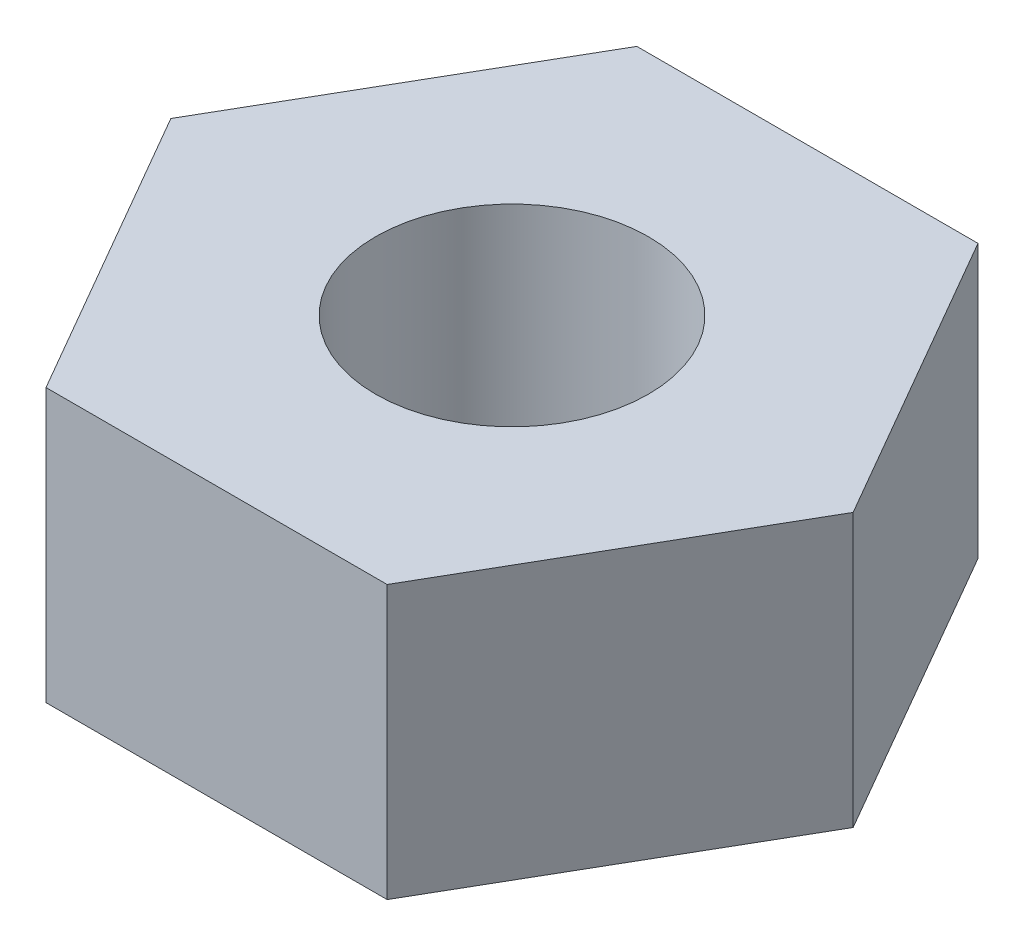
ISO-10303-21;
HEADER;
FILE_DESCRIPTION(('STEP AP214'),'2;1');
FILE_NAME('part.step','',(''),(''),'','','');
FILE_SCHEMA(('AUTOMOTIVE_DESIGN { 1 0 10303 214 1 1 1 1 }'));
ENDSEC;
DATA;
#1=APPLICATION_CONTEXT('core data for automotive mechanical design processes');
#2=APPLICATION_PROTOCOL_DEFINITION('international standard','automotive_design',2000,#1);
#3=PRODUCT_CONTEXT('',#1,'mechanical');
#4=PRODUCT('Part','Part','',(#3));
#5=PRODUCT_RELATED_PRODUCT_CATEGORY('part','',(#4));
#6=PRODUCT_DEFINITION_FORMATION('','',#4);
#7=PRODUCT_DEFINITION_CONTEXT('part definition',#1,'design');
#8=PRODUCT_DEFINITION('design','',#6,#7);
#9=PRODUCT_DEFINITION_SHAPE('','',#8);
#10=(LENGTH_UNIT() NAMED_UNIT(*) SI_UNIT(.MILLI.,.METRE.));
#11=(NAMED_UNIT(*) PLANE_ANGLE_UNIT() SI_UNIT($,.RADIAN.));
#12=(NAMED_UNIT(*) SI_UNIT($,.STERADIAN.) SOLID_ANGLE_UNIT());
#13=UNCERTAINTY_MEASURE_WITH_UNIT(LENGTH_MEASURE(1.E-05),#10,'distance_accuracy_value','');
#14=(GEOMETRIC_REPRESENTATION_CONTEXT(3) GLOBAL_UNCERTAINTY_ASSIGNED_CONTEXT((#13)) GLOBAL_UNIT_ASSIGNED_CONTEXT((#10,
#11,#12)) REPRESENTATION_CONTEXT('',''));
#15=CARTESIAN_POINT('',(0.,0.,0.));
#16=DIRECTION('',(0.,0.,1.));
#17=DIRECTION('',(1.,0.,0.));
#18=AXIS2_PLACEMENT_3D('',#15,#16,#17);
#19=CARTESIAN_POINT('',(0.,4.,0.));
#20=DIRECTION('',(0.,1.,0.));
#21=DIRECTION('',(0.,0.,1.));
#22=AXIS2_PLACEMENT_3D('',#19,#20,#21);
#23=PLANE('',#22);
#24=DIRECTION('',(0.499999999999995,0.,-0.866025403784441));
#25=VECTOR('',#24,1.);
#26=CARTESIAN_POINT('',(2.50000000000005,4.,4.33012701892216));
#27=LINE('',#26,#25);
#28=CARTESIAN_POINT('',(2.50000000000005,4.,4.33012701892216));
#29=VERTEX_POINT('',#28);
#30=CARTESIAN_POINT('',(5.,4.,0.));
#31=VERTEX_POINT('',#30);
#32=EDGE_CURVE('E135',#29,#31,#27,.T.);
#33=ORIENTED_EDGE('',*,*,#32,.T.);
#34=DIRECTION('',(-0.500000000000001,0.,-0.866025403784438));
#35=VECTOR('',#34,1.);
#36=CARTESIAN_POINT('',(5.,4.,0.));
#37=LINE('',#36,#35);
#38=CARTESIAN_POINT('',(2.49999999999999,4.,-4.3301270189222));
#39=VERTEX_POINT('',#38);
#40=EDGE_CURVE('E93',#31,#39,#37,.T.);
#41=ORIENTED_EDGE('',*,*,#40,.T.);
#42=DIRECTION('',(-1.,0.,0.));
#43=VECTOR('',#42,1.);
#44=CARTESIAN_POINT('',(2.49999999999999,4.,-4.3301270189222));
#45=LINE('',#44,#43);
#46=CARTESIAN_POINT('',(-2.50000000000002,4.,-4.33012701892218));
#47=VERTEX_POINT('',#46);
#48=EDGE_CURVE('E106',#39,#47,#45,.T.);
#49=ORIENTED_EDGE('',*,*,#48,.T.);
#50=DIRECTION('',(-0.499999999999995,0.,0.866025403784442));
#51=VECTOR('',#50,1.);
#52=CARTESIAN_POINT('',(-2.50000000000002,4.,-4.33012701892218));
#53=LINE('',#52,#51);
#54=CARTESIAN_POINT('',(-5.,4.,0.));
#55=VERTEX_POINT('',#54);
#56=EDGE_CURVE('E100',#47,#55,#53,.T.);
#57=ORIENTED_EDGE('',*,*,#56,.T.);
#58=DIRECTION('',(0.500000000000007,0.,0.866025403784434));
#59=VECTOR('',#58,1.);
#60=CARTESIAN_POINT('',(-5.,4.,0.));
#61=LINE('',#60,#59);
#62=CARTESIAN_POINT('',(-2.49999999999996,4.,4.33012701892222));
#63=VERTEX_POINT('',#62);
#64=EDGE_CURVE('E104',#55,#63,#61,.T.);
#65=ORIENTED_EDGE('',*,*,#64,.T.);
#66=DIRECTION('',(1.,0.,0.));
#67=VECTOR('',#66,1.);
#68=CARTESIAN_POINT('',(-2.49999999999996,4.,4.33012701892222));
#69=LINE('',#68,#67);
#70=EDGE_CURVE('E56',#63,#29,#69,.T.);
#71=ORIENTED_EDGE('',*,*,#70,.T.);
#72=EDGE_LOOP('',(#33,#41,#49,#57,#65,#71));
#73=FACE_BOUND('',#72,.T.);
#74=CARTESIAN_POINT('',(0.,4.,0.));
#75=DIRECTION('',(0.,1.,0.));
#76=DIRECTION('',(0.,0.,1.));
#77=AXIS2_PLACEMENT_3D('',#74,#75,#76);
#78=CIRCLE('',#77,2.);
#79=CARTESIAN_POINT('',(0.,4.,2.));
#80=VERTEX_POINT('',#79);
#81=EDGE_CURVE('E128',#80,#80,#78,.T.);
#82=ORIENTED_EDGE('',*,*,#81,.F.);
#83=EDGE_LOOP('',(#82));
#84=FACE_BOUND('',#83,.T.);
#85=ADVANCED_FACE('F39',(#73,#84),#23,.T.);
#86=CARTESIAN_POINT('',(0.,0.,0.));
#87=DIRECTION('',(0.,1.,0.));
#88=DIRECTION('',(0.,0.,1.));
#89=AXIS2_PLACEMENT_3D('',#86,#87,#88);
#90=PLANE('',#89);
#91=DIRECTION('',(0.499999999999995,0.,-0.866025403784441));
#92=VECTOR('',#91,1.);
#93=CARTESIAN_POINT('',(2.50000000000005,0.,4.33012701892216));
#94=LINE('',#93,#92);
#95=CARTESIAN_POINT('',(2.50000000000005,0.,4.33012701892216));
#96=VERTEX_POINT('',#95);
#97=CARTESIAN_POINT('',(5.,0.,0.));
#98=VERTEX_POINT('',#97);
#99=EDGE_CURVE('E124',#96,#98,#94,.T.);
#100=ORIENTED_EDGE('',*,*,#99,.F.);
#101=DIRECTION('',(1.,0.,0.));
#102=VECTOR('',#101,1.);
#103=CARTESIAN_POINT('',(-2.49999999999996,0.,4.33012701892222));
#104=LINE('',#103,#102);
#105=CARTESIAN_POINT('',(-2.49999999999996,0.,4.33012701892222));
#106=VERTEX_POINT('',#105);
#107=EDGE_CURVE('E85',#106,#96,#104,.T.);
#108=ORIENTED_EDGE('',*,*,#107,.F.);
#109=DIRECTION('',(0.500000000000007,0.,0.866025403784434));
#110=VECTOR('',#109,1.);
#111=CARTESIAN_POINT('',(-5.,0.,0.));
#112=LINE('',#111,#110);
#113=CARTESIAN_POINT('',(-5.,0.,0.));
#114=VERTEX_POINT('',#113);
#115=EDGE_CURVE('E79',#114,#106,#112,.T.);
#116=ORIENTED_EDGE('',*,*,#115,.F.);
#117=DIRECTION('',(-0.499999999999995,0.,0.866025403784442));
#118=VECTOR('',#117,1.);
#119=CARTESIAN_POINT('',(-2.50000000000002,0.,-4.33012701892218));
#120=LINE('',#119,#118);
#121=CARTESIAN_POINT('',(-2.50000000000002,0.,-4.33012701892218));
#122=VERTEX_POINT('',#121);
#123=EDGE_CURVE('E114',#122,#114,#120,.T.);
#124=ORIENTED_EDGE('',*,*,#123,.F.);
#125=DIRECTION('',(-1.,0.,0.));
#126=VECTOR('',#125,1.);
#127=CARTESIAN_POINT('',(2.49999999999999,0.,-4.3301270189222));
#128=LINE('',#127,#126);
#129=CARTESIAN_POINT('',(2.49999999999999,0.,-4.3301270189222));
#130=VERTEX_POINT('',#129);
#131=EDGE_CURVE('E130',#130,#122,#128,.T.);
#132=ORIENTED_EDGE('',*,*,#131,.F.);
#133=DIRECTION('',(-0.500000000000001,0.,-0.866025403784438));
#134=VECTOR('',#133,1.);
#135=CARTESIAN_POINT('',(5.,0.,0.));
#136=LINE('',#135,#134);
#137=EDGE_CURVE('E127',#98,#130,#136,.T.);
#138=ORIENTED_EDGE('',*,*,#137,.F.);
#139=EDGE_LOOP('',(#100,#108,#116,#124,#132,#138));
#140=FACE_BOUND('',#139,.T.);
#141=CARTESIAN_POINT('',(0.,0.,0.));
#142=DIRECTION('',(0.,1.,0.));
#143=DIRECTION('',(0.,0.,1.));
#144=AXIS2_PLACEMENT_3D('',#141,#142,#143);
#145=CIRCLE('',#144,2.);
#146=CARTESIAN_POINT('',(0.,0.,2.));
#147=VERTEX_POINT('',#146);
#148=EDGE_CURVE('E228',#147,#147,#145,.T.);
#149=ORIENTED_EDGE('',*,*,#148,.T.);
#150=EDGE_LOOP('',(#149));
#151=FACE_BOUND('',#150,.T.);
#152=ADVANCED_FACE('F144',(#140,#151),#90,.F.);
#153=CARTESIAN_POINT('',(2.50000000000005,4.,4.33012701892216));
#154=DIRECTION('',(-0.866025403784441,0.,-0.499999999999995));
#155=DIRECTION('',(-0.499999999999995,0.,0.866025403784442));
#156=AXIS2_PLACEMENT_3D('',#153,#154,#155);
#157=PLANE('',#156);
#158=ORIENTED_EDGE('',*,*,#99,.T.);
#159=DIRECTION('',(0.,-1.,0.));
#160=VECTOR('',#159,1.);
#161=CARTESIAN_POINT('',(5.,4.,0.));
#162=LINE('',#161,#160);
#163=EDGE_CURVE('E11',#31,#98,#162,.T.);
#164=ORIENTED_EDGE('',*,*,#163,.F.);
#165=ORIENTED_EDGE('',*,*,#32,.F.);
#166=DIRECTION('',(0.,-1.,0.));
#167=VECTOR('',#166,1.);
#168=CARTESIAN_POINT('',(2.50000000000005,4.,4.33012701892216));
#169=LINE('',#168,#167);
#170=EDGE_CURVE('E120',#29,#96,#169,.T.);
#171=ORIENTED_EDGE('',*,*,#170,.T.);
#172=EDGE_LOOP('',(#158,#164,#165,#171));
#173=FACE_BOUND('',#172,.T.);
#174=ADVANCED_FACE('F41',(#173),#157,.F.);
#175=CARTESIAN_POINT('',(5.,4.,0.));
#176=DIRECTION('',(-0.866025403784438,0.,0.500000000000001));
#177=DIRECTION('',(0.500000000000001,0.,0.866025403784438));
#178=AXIS2_PLACEMENT_3D('',#175,#176,#177);
#179=PLANE('',#178);
#180=ORIENTED_EDGE('',*,*,#137,.T.);
#181=DIRECTION('',(0.,-1.,0.));
#182=VECTOR('',#181,1.);
#183=CARTESIAN_POINT('',(2.49999999999999,4.,-4.3301270189222));
#184=LINE('',#183,#182);
#185=EDGE_CURVE('E48',#39,#130,#184,.T.);
#186=ORIENTED_EDGE('',*,*,#185,.F.);
#187=ORIENTED_EDGE('',*,*,#40,.F.);
#188=ORIENTED_EDGE('',*,*,#163,.T.);
#189=EDGE_LOOP('',(#180,#186,#187,#188));
#190=FACE_BOUND('',#189,.T.);
#191=ADVANCED_FACE('F169',(#190),#179,.F.);
#192=CARTESIAN_POINT('',(2.49999999999999,4.,-4.3301270189222));
#193=DIRECTION('',(0.,0.,1.));
#194=DIRECTION('',(1.,0.,0.));
#195=AXIS2_PLACEMENT_3D('',#192,#193,#194);
#196=PLANE('',#195);
#197=ORIENTED_EDGE('',*,*,#131,.T.);
#198=DIRECTION('',(0.,-1.,0.));
#199=VECTOR('',#198,1.);
#200=CARTESIAN_POINT('',(-2.50000000000002,4.,-4.33012701892218));
#201=LINE('',#200,#199);
#202=EDGE_CURVE('E115',#47,#122,#201,.T.);
#203=ORIENTED_EDGE('',*,*,#202,.F.);
#204=ORIENTED_EDGE('',*,*,#48,.F.);
#205=ORIENTED_EDGE('',*,*,#185,.T.);
#206=EDGE_LOOP('',(#197,#203,#204,#205));
#207=FACE_BOUND('',#206,.T.);
#208=ADVANCED_FACE('F141',(#207),#196,.F.);
#209=CARTESIAN_POINT('',(-2.50000000000002,4.,-4.33012701892218));
#210=DIRECTION('',(0.866025403784442,0.,0.499999999999995));
#211=DIRECTION('',(0.499999999999995,0.,-0.866025403784442));
#212=AXIS2_PLACEMENT_3D('',#209,#210,#211);
#213=PLANE('',#212);
#214=ORIENTED_EDGE('',*,*,#123,.T.);
#215=DIRECTION('',(0.,-1.,0.));
#216=VECTOR('',#215,1.);
#217=CARTESIAN_POINT('',(-5.,4.,0.));
#218=LINE('',#217,#216);
#219=EDGE_CURVE('E111',#55,#114,#218,.T.);
#220=ORIENTED_EDGE('',*,*,#219,.F.);
#221=ORIENTED_EDGE('',*,*,#56,.F.);
#222=ORIENTED_EDGE('',*,*,#202,.T.);
#223=EDGE_LOOP('',(#214,#220,#221,#222));
#224=FACE_BOUND('',#223,.T.);
#225=ADVANCED_FACE('F112',(#224),#213,.F.);
#226=CARTESIAN_POINT('',(-5.,4.,0.));
#227=DIRECTION('',(0.866025403784435,0.,-0.500000000000007));
#228=DIRECTION('',(-0.500000000000007,0.,-0.866025403784435));
#229=AXIS2_PLACEMENT_3D('',#226,#227,#228);
#230=PLANE('',#229);
#231=ORIENTED_EDGE('',*,*,#115,.T.);
#232=DIRECTION('',(0.,-1.,0.));
#233=VECTOR('',#232,1.);
#234=CARTESIAN_POINT('',(-2.49999999999996,4.,4.33012701892222));
#235=LINE('',#234,#233);
#236=EDGE_CURVE('E116',#63,#106,#235,.T.);
#237=ORIENTED_EDGE('',*,*,#236,.F.);
#238=ORIENTED_EDGE('',*,*,#64,.F.);
#239=ORIENTED_EDGE('',*,*,#219,.T.);
#240=EDGE_LOOP('',(#231,#237,#238,#239));
#241=FACE_BOUND('',#240,.T.);
#242=ADVANCED_FACE('F118',(#241),#230,.F.);
#243=CARTESIAN_POINT('',(-2.49999999999996,4.,4.33012701892222));
#244=DIRECTION('',(0.,0.,-1.));
#245=DIRECTION('',(-1.,0.,0.));
#246=AXIS2_PLACEMENT_3D('',#243,#244,#245);
#247=PLANE('',#246);
#248=ORIENTED_EDGE('',*,*,#107,.T.);
#249=ORIENTED_EDGE('',*,*,#170,.F.);
#250=ORIENTED_EDGE('',*,*,#70,.F.);
#251=ORIENTED_EDGE('',*,*,#236,.T.);
#252=EDGE_LOOP('',(#248,#249,#250,#251));
#253=FACE_BOUND('',#252,.T.);
#254=ADVANCED_FACE('F149',(#253),#247,.F.);
#255=CARTESIAN_POINT('',(0.,4.,0.));
#256=DIRECTION('',(0.,-1.,0.));
#257=DIRECTION('',(0.,0.,-1.));
#258=AXIS2_PLACEMENT_3D('',#255,#256,#257);
#259=CYLINDRICAL_SURFACE('',#258,2.);
#260=ORIENTED_EDGE('',*,*,#81,.T.);
#261=EDGE_LOOP('',(#260));
#262=FACE_BOUND('',#261,.T.);
#263=ORIENTED_EDGE('',*,*,#148,.F.);
#264=EDGE_LOOP('',(#263));
#265=FACE_BOUND('',#264,.T.);
#266=ADVANCED_FACE('F151',(#262,#265),#259,.F.);
#267=CLOSED_SHELL('',(#85,#152,#174,#191,#208,#225,#242,#254,#266));
#268=MANIFOLD_SOLID_BREP('B2',#267);
#269=ADVANCED_BREP_SHAPE_REPRESENTATION('',(#18,#268),#14);
#270=SHAPE_DEFINITION_REPRESENTATION(#9,#269);
ENDSEC;
END-ISO-10303-21;
